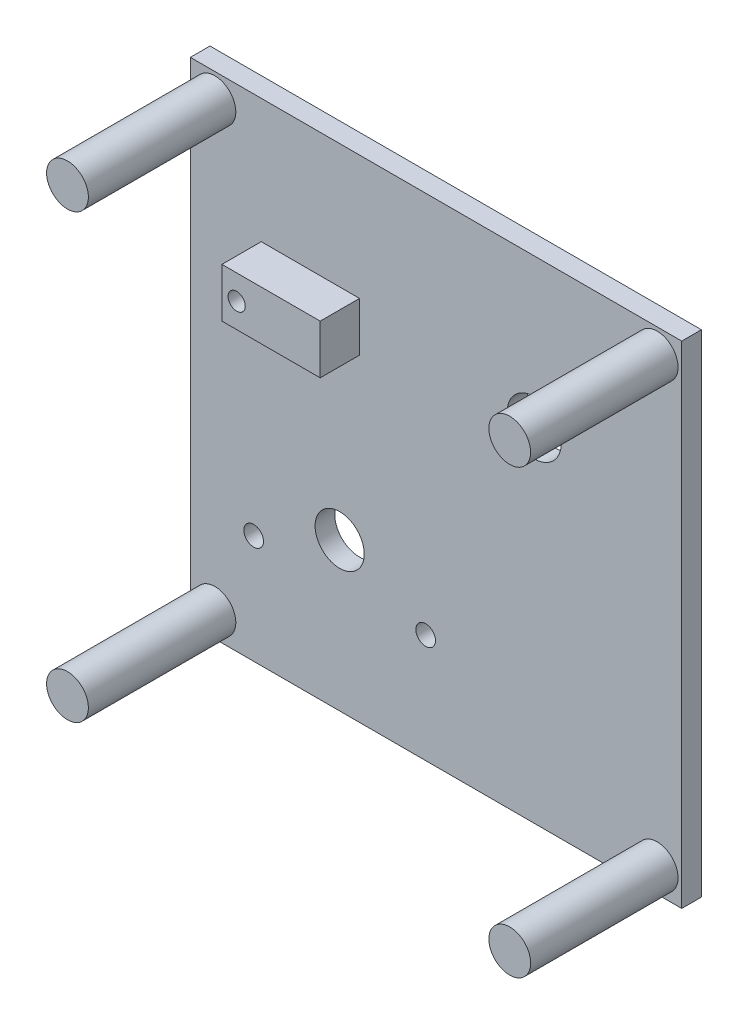
ISO-10303-21;
HEADER;
FILE_DESCRIPTION(('STEP AP214'),'2;1');
FILE_NAME('part.step','',(''),(''),'','','');
FILE_SCHEMA(('AUTOMOTIVE_DESIGN { 1 0 10303 214 1 1 1 1 }'));
ENDSEC;
DATA;
#1=APPLICATION_CONTEXT('core data for automotive mechanical design processes');
#2=APPLICATION_PROTOCOL_DEFINITION('international standard','automotive_design',2000,#1);
#3=PRODUCT_CONTEXT('',#1,'mechanical');
#4=PRODUCT('Part','Part','',(#3));
#5=PRODUCT_RELATED_PRODUCT_CATEGORY('part','',(#4));
#6=PRODUCT_DEFINITION_FORMATION('','',#4);
#7=PRODUCT_DEFINITION_CONTEXT('part definition',#1,'design');
#8=PRODUCT_DEFINITION('design','',#6,#7);
#9=PRODUCT_DEFINITION_SHAPE('','',#8);
#10=(LENGTH_UNIT() NAMED_UNIT(*) SI_UNIT(.MILLI.,.METRE.));
#11=(NAMED_UNIT(*) PLANE_ANGLE_UNIT() SI_UNIT($,.RADIAN.));
#12=(NAMED_UNIT(*) SI_UNIT($,.STERADIAN.) SOLID_ANGLE_UNIT());
#13=UNCERTAINTY_MEASURE_WITH_UNIT(LENGTH_MEASURE(1.E-05),#10,'distance_accuracy_value','');
#14=(GEOMETRIC_REPRESENTATION_CONTEXT(3) GLOBAL_UNCERTAINTY_ASSIGNED_CONTEXT((#13)) GLOBAL_UNIT_ASSIGNED_CONTEXT((#10,
#11,#12)) REPRESENTATION_CONTEXT('',''));
#15=CARTESIAN_POINT('',(0.,0.,0.));
#16=DIRECTION('',(0.,0.,1.));
#17=DIRECTION('',(1.,0.,0.));
#18=AXIS2_PLACEMENT_3D('',#15,#16,#17);
#19=CARTESIAN_POINT('',(50.,-50.,4.));
#20=DIRECTION('',(-1.,0.,0.));
#21=DIRECTION('',(0.,0.,1.));
#22=AXIS2_PLACEMENT_3D('',#19,#20,#21);
#23=PLANE('',#22);
#24=DIRECTION('',(0.,1.,0.));
#25=VECTOR('',#24,1.);
#26=CARTESIAN_POINT('',(50.,-50.,0.));
#27=LINE('',#26,#25);
#28=CARTESIAN_POINT('',(50.,-50.,0.));
#29=VERTEX_POINT('',#28);
#30=CARTESIAN_POINT('',(50.,50.,0.));
#31=VERTEX_POINT('',#30);
#32=EDGE_CURVE('E177',#29,#31,#27,.T.);
#33=ORIENTED_EDGE('',*,*,#32,.T.);
#34=DIRECTION('',(0.,0.,-1.));
#35=VECTOR('',#34,1.);
#36=CARTESIAN_POINT('',(50.,50.,4.));
#37=LINE('',#36,#35);
#38=CARTESIAN_POINT('',(50.,50.,4.));
#39=VERTEX_POINT('',#38);
#40=EDGE_CURVE('E204',#39,#31,#37,.T.);
#41=ORIENTED_EDGE('',*,*,#40,.F.);
#42=DIRECTION('',(0.,1.,0.));
#43=VECTOR('',#42,1.);
#44=CARTESIAN_POINT('',(50.,-50.,4.));
#45=LINE('',#44,#43);
#46=CARTESIAN_POINT('',(50.,-50.,4.));
#47=VERTEX_POINT('',#46);
#48=EDGE_CURVE('E178',#47,#39,#45,.T.);
#49=ORIENTED_EDGE('',*,*,#48,.F.);
#50=DIRECTION('',(0.,0.,-1.));
#51=VECTOR('',#50,1.);
#52=CARTESIAN_POINT('',(50.,-50.,4.));
#53=LINE('',#52,#51);
#54=EDGE_CURVE('E188',#47,#29,#53,.T.);
#55=ORIENTED_EDGE('',*,*,#54,.T.);
#56=EDGE_LOOP('',(#33,#41,#49,#55));
#57=FACE_BOUND('',#56,.T.);
#58=ADVANCED_FACE('F32',(#57),#23,.F.);
#59=CARTESIAN_POINT('',(-50.,50.,4.));
#60=DIRECTION('',(0.,-1.,0.));
#61=DIRECTION('',(0.,0.,-1.));
#62=AXIS2_PLACEMENT_3D('',#59,#60,#61);
#63=PLANE('',#62);
#64=DIRECTION('',(-1.,0.,0.));
#65=VECTOR('',#64,1.);
#66=CARTESIAN_POINT('',(-50.,50.,0.));
#67=LINE('',#66,#65);
#68=CARTESIAN_POINT('',(-50.,50.,0.));
#69=VERTEX_POINT('',#68);
#70=EDGE_CURVE('E191',#31,#69,#67,.T.);
#71=ORIENTED_EDGE('',*,*,#70,.T.);
#72=DIRECTION('',(0.,0.,-1.));
#73=VECTOR('',#72,1.);
#74=CARTESIAN_POINT('',(-50.,50.,4.));
#75=LINE('',#74,#73);
#76=CARTESIAN_POINT('',(-50.,50.,4.));
#77=VERTEX_POINT('',#76);
#78=EDGE_CURVE('E201',#77,#69,#75,.T.);
#79=ORIENTED_EDGE('',*,*,#78,.F.);
#80=DIRECTION('',(-1.,0.,0.));
#81=VECTOR('',#80,1.);
#82=CARTESIAN_POINT('',(-50.,50.,4.));
#83=LINE('',#82,#81);
#84=EDGE_CURVE('E181',#39,#77,#83,.T.);
#85=ORIENTED_EDGE('',*,*,#84,.F.);
#86=ORIENTED_EDGE('',*,*,#40,.T.);
#87=EDGE_LOOP('',(#71,#79,#85,#86));
#88=FACE_BOUND('',#87,.T.);
#89=ADVANCED_FACE('F237',(#88),#63,.F.);
#90=CARTESIAN_POINT('',(-50.,-50.,4.));
#91=DIRECTION('',(1.,0.,0.));
#92=DIRECTION('',(0.,0.,-1.));
#93=AXIS2_PLACEMENT_3D('',#90,#91,#92);
#94=PLANE('',#93);
#95=DIRECTION('',(0.,-1.,0.));
#96=VECTOR('',#95,1.);
#97=CARTESIAN_POINT('',(-50.,-50.,0.));
#98=LINE('',#97,#96);
#99=CARTESIAN_POINT('',(-50.,-50.,0.));
#100=VERTEX_POINT('',#99);
#101=EDGE_CURVE('E193',#69,#100,#98,.T.);
#102=ORIENTED_EDGE('',*,*,#101,.T.);
#103=DIRECTION('',(0.,0.,-1.));
#104=VECTOR('',#103,1.);
#105=CARTESIAN_POINT('',(-50.,-50.,4.));
#106=LINE('',#105,#104);
#107=CARTESIAN_POINT('',(-50.,-50.,4.));
#108=VERTEX_POINT('',#107);
#109=EDGE_CURVE('E198',#108,#100,#106,.T.);
#110=ORIENTED_EDGE('',*,*,#109,.F.);
#111=DIRECTION('',(0.,-1.,0.));
#112=VECTOR('',#111,1.);
#113=CARTESIAN_POINT('',(-50.,-50.,4.));
#114=LINE('',#113,#112);
#115=EDGE_CURVE('E184',#77,#108,#114,.T.);
#116=ORIENTED_EDGE('',*,*,#115,.F.);
#117=ORIENTED_EDGE('',*,*,#78,.T.);
#118=EDGE_LOOP('',(#102,#110,#116,#117));
#119=FACE_BOUND('',#118,.T.);
#120=ADVANCED_FACE('F242',(#119),#94,.F.);
#121=CARTESIAN_POINT('',(-50.,-50.,4.));
#122=DIRECTION('',(0.,1.,0.));
#123=DIRECTION('',(0.,0.,1.));
#124=AXIS2_PLACEMENT_3D('',#121,#122,#123);
#125=PLANE('',#124);
#126=DIRECTION('',(1.,0.,0.));
#127=VECTOR('',#126,1.);
#128=CARTESIAN_POINT('',(-50.,-50.,0.));
#129=LINE('',#128,#127);
#130=EDGE_CURVE('E182',#100,#29,#129,.T.);
#131=ORIENTED_EDGE('',*,*,#130,.T.);
#132=ORIENTED_EDGE('',*,*,#54,.F.);
#133=DIRECTION('',(1.,0.,0.));
#134=VECTOR('',#133,1.);
#135=CARTESIAN_POINT('',(-50.,-50.,4.));
#136=LINE('',#135,#134);
#137=EDGE_CURVE('E186',#108,#47,#136,.T.);
#138=ORIENTED_EDGE('',*,*,#137,.F.);
#139=ORIENTED_EDGE('',*,*,#109,.T.);
#140=EDGE_LOOP('',(#131,#132,#138,#139));
#141=FACE_BOUND('',#140,.T.);
#142=ADVANCED_FACE('F221',(#141),#125,.F.);
#143=CARTESIAN_POINT('',(0.,0.,4.));
#144=DIRECTION('',(0.,0.,-1.));
#145=DIRECTION('',(-1.,0.,0.));
#146=AXIS2_PLACEMENT_3D('',#143,#144,#145);
#147=PLANE('',#146);
#148=CARTESIAN_POINT('',(19.9832422219013,19.7310085100066,4.));
#149=DIRECTION('',(0.,0.,-1.));
#150=DIRECTION('',(-1.,0.,0.));
#151=AXIS2_PLACEMENT_3D('',#148,#149,#150);
#152=CIRCLE('',#151,5.5);
#153=CARTESIAN_POINT('',(14.4832422219013,19.7310085100066,4.));
#154=VERTEX_POINT('',#153);
#155=EDGE_CURVE('E595',#154,#154,#152,.T.);
#156=ORIENTED_EDGE('',*,*,#155,.T.);
#157=EDGE_LOOP('',(#156));
#158=FACE_BOUND('',#157,.T.);
#159=DIRECTION('',(0.,1.,0.));
#160=VECTOR('',#159,1.);
#161=CARTESIAN_POINT('',(-15.5711530411997,14.7310085100066,4.));
#162=LINE('',#161,#160);
#163=CARTESIAN_POINT('',(-15.5711530411997,14.7310085100066,4.));
#164=VERTEX_POINT('',#163);
#165=CARTESIAN_POINT('',(-15.5711530411997,24.7310085100066,4.));
#166=VERTEX_POINT('',#165);
#167=EDGE_CURVE('E117',#164,#166,#162,.T.);
#168=ORIENTED_EDGE('',*,*,#167,.F.);
#169=DIRECTION('',(1.,0.,0.));
#170=VECTOR('',#169,1.);
#171=CARTESIAN_POINT('',(-35.5711530411997,14.7310085100066,4.));
#172=LINE('',#171,#170);
#173=CARTESIAN_POINT('',(-35.5711530411997,14.7310085100066,4.));
#174=VERTEX_POINT('',#173);
#175=EDGE_CURVE('E114',#174,#164,#172,.T.);
#176=ORIENTED_EDGE('',*,*,#175,.F.);
#177=DIRECTION('',(0.,-1.,0.));
#178=VECTOR('',#177,1.);
#179=CARTESIAN_POINT('',(-35.5711530411997,14.7310085100066,4.));
#180=LINE('',#179,#178);
#181=CARTESIAN_POINT('',(-35.5711530411997,24.7310085100066,4.));
#182=VERTEX_POINT('',#181);
#183=EDGE_CURVE('E51',#182,#174,#180,.T.);
#184=ORIENTED_EDGE('',*,*,#183,.F.);
#185=DIRECTION('',(-1.,0.,0.));
#186=VECTOR('',#185,1.);
#187=CARTESIAN_POINT('',(-35.5711530411997,24.7310085100066,4.));
#188=LINE('',#187,#186);
#189=EDGE_CURVE('E46',#166,#182,#188,.T.);
#190=ORIENTED_EDGE('',*,*,#189,.F.);
#191=EDGE_LOOP('',(#168,#176,#184,#190));
#192=FACE_BOUND('',#191,.T.);
#193=CARTESIAN_POINT('',(-37.1117120269709,-27.8639457388657,4.));
#194=DIRECTION('',(0.,0.,-1.));
#195=DIRECTION('',(-1.,0.,0.));
#196=AXIS2_PLACEMENT_3D('',#193,#194,#195);
#197=CIRCLE('',#196,2.00000000000001);
#198=CARTESIAN_POINT('',(-39.1117120269709,-27.8639457388657,4.));
#199=VERTEX_POINT('',#198);
#200=EDGE_CURVE('E132',#199,#199,#197,.T.);
#201=ORIENTED_EDGE('',*,*,#200,.T.);
#202=EDGE_LOOP('',(#201));
#203=FACE_BOUND('',#202,.T.);
#204=CARTESIAN_POINT('',(-19.6117120269709,-19.8639457388657,4.));
#205=DIRECTION('',(0.,0.,-1.));
#206=DIRECTION('',(-1.,0.,0.));
#207=AXIS2_PLACEMENT_3D('',#204,#205,#206);
#208=CIRCLE('',#207,5.00000000000001);
#209=CARTESIAN_POINT('',(-24.6117120269709,-19.8639457388657,4.));
#210=VERTEX_POINT('',#209);
#211=EDGE_CURVE('E128',#210,#210,#208,.T.);
#212=ORIENTED_EDGE('',*,*,#211,.T.);
#213=EDGE_LOOP('',(#212));
#214=FACE_BOUND('',#213,.T.);
#215=CARTESIAN_POINT('',(-2.11171202697091,-27.8639457388657,4.));
#216=DIRECTION('',(0.,0.,-1.));
#217=DIRECTION('',(-1.,0.,0.));
#218=AXIS2_PLACEMENT_3D('',#215,#216,#217);
#219=CIRCLE('',#218,2.);
#220=CARTESIAN_POINT('',(-4.11171202697092,-27.8639457388657,4.));
#221=VERTEX_POINT('',#220);
#222=EDGE_CURVE('E138',#221,#221,#219,.T.);
#223=ORIENTED_EDGE('',*,*,#222,.T.);
#224=EDGE_LOOP('',(#223));
#225=FACE_BOUND('',#224,.T.);
#226=CARTESIAN_POINT('',(45.,-45.,4.));
#227=DIRECTION('',(0.,0.,-1.));
#228=DIRECTION('',(-1.,0.,0.));
#229=AXIS2_PLACEMENT_3D('',#226,#227,#228);
#230=CIRCLE('',#229,4.25);
#231=CARTESIAN_POINT('',(40.75,-45.,4.));
#232=VERTEX_POINT('',#231);
#233=EDGE_CURVE('E11',#232,#232,#230,.F.);
#234=ORIENTED_EDGE('',*,*,#233,.F.);
#235=EDGE_LOOP('',(#234));
#236=FACE_BOUND('',#235,.T.);
#237=CARTESIAN_POINT('',(-45.,-45.,4.));
#238=DIRECTION('',(0.,0.,-1.));
#239=DIRECTION('',(-1.,0.,0.));
#240=AXIS2_PLACEMENT_3D('',#237,#238,#239);
#241=CIRCLE('',#240,4.25);
#242=CARTESIAN_POINT('',(-49.25,-45.,4.));
#243=VERTEX_POINT('',#242);
#244=EDGE_CURVE('E39',#243,#243,#241,.F.);
#245=ORIENTED_EDGE('',*,*,#244,.F.);
#246=EDGE_LOOP('',(#245));
#247=FACE_BOUND('',#246,.T.);
#248=CARTESIAN_POINT('',(-45.,45.,4.));
#249=DIRECTION('',(0.,0.,-1.));
#250=DIRECTION('',(-1.,0.,0.));
#251=AXIS2_PLACEMENT_3D('',#248,#249,#250);
#252=CIRCLE('',#251,4.25);
#253=CARTESIAN_POINT('',(-49.25,45.,4.));
#254=VERTEX_POINT('',#253);
#255=EDGE_CURVE('E210',#254,#254,#252,.F.);
#256=ORIENTED_EDGE('',*,*,#255,.F.);
#257=EDGE_LOOP('',(#256));
#258=FACE_BOUND('',#257,.T.);
#259=CARTESIAN_POINT('',(45.,45.,4.));
#260=DIRECTION('',(0.,0.,-1.));
#261=DIRECTION('',(-1.,0.,0.));
#262=AXIS2_PLACEMENT_3D('',#259,#260,#261);
#263=CIRCLE('',#262,4.25);
#264=CARTESIAN_POINT('',(40.75,45.,4.));
#265=VERTEX_POINT('',#264);
#266=EDGE_CURVE('E207',#265,#265,#263,.F.);
#267=ORIENTED_EDGE('',*,*,#266,.F.);
#268=EDGE_LOOP('',(#267));
#269=FACE_BOUND('',#268,.T.);
#270=ORIENTED_EDGE('',*,*,#48,.T.);
#271=ORIENTED_EDGE('',*,*,#84,.T.);
#272=ORIENTED_EDGE('',*,*,#115,.T.);
#273=ORIENTED_EDGE('',*,*,#137,.T.);
#274=EDGE_LOOP('',(#270,#271,#272,#273));
#275=FACE_BOUND('',#274,.T.);
#276=ADVANCED_FACE('F217',(#158,#192,#203,#214,#225,#236,#247,#258,#269,#275),#147,.F.);
#277=CARTESIAN_POINT('',(0.,0.,0.));
#278=DIRECTION('',(0.,0.,-1.));
#279=DIRECTION('',(-1.,0.,0.));
#280=AXIS2_PLACEMENT_3D('',#277,#278,#279);
#281=PLANE('',#280);
#282=CARTESIAN_POINT('',(19.9832422219013,19.7310085100066,0.));
#283=DIRECTION('',(0.,0.,-1.));
#284=DIRECTION('',(-1.,0.,0.));
#285=AXIS2_PLACEMENT_3D('',#282,#283,#284);
#286=CIRCLE('',#285,5.5);
#287=CARTESIAN_POINT('',(14.4832422219013,19.7310085100066,0.));
#288=VERTEX_POINT('',#287);
#289=EDGE_CURVE('E600',#288,#288,#286,.T.);
#290=ORIENTED_EDGE('',*,*,#289,.F.);
#291=EDGE_LOOP('',(#290));
#292=FACE_BOUND('',#291,.T.);
#293=CARTESIAN_POINT('',(-37.1117120269709,-27.8639457388657,0.));
#294=DIRECTION('',(0.,0.,1.));
#295=DIRECTION('',(1.,0.,0.));
#296=AXIS2_PLACEMENT_3D('',#293,#294,#295);
#297=CIRCLE('',#296,2.00000000000001);
#298=CARTESIAN_POINT('',(-35.1117120269709,-27.8639457388657,0.));
#299=VERTEX_POINT('',#298);
#300=EDGE_CURVE('E121',#299,#299,#297,.T.);
#301=ORIENTED_EDGE('',*,*,#300,.T.);
#302=EDGE_LOOP('',(#301));
#303=FACE_BOUND('',#302,.T.);
#304=CARTESIAN_POINT('',(-19.6117120269709,-19.8639457388657,0.));
#305=DIRECTION('',(0.,0.,1.));
#306=DIRECTION('',(1.,0.,0.));
#307=AXIS2_PLACEMENT_3D('',#304,#305,#306);
#308=CIRCLE('',#307,5.00000000000001);
#309=CARTESIAN_POINT('',(-14.6117120269709,-19.8639457388657,0.));
#310=VERTEX_POINT('',#309);
#311=EDGE_CURVE('E118',#310,#310,#308,.T.);
#312=ORIENTED_EDGE('',*,*,#311,.T.);
#313=EDGE_LOOP('',(#312));
#314=FACE_BOUND('',#313,.T.);
#315=CARTESIAN_POINT('',(-2.11171202697091,-27.8639457388657,0.));
#316=DIRECTION('',(0.,0.,1.));
#317=DIRECTION('',(1.,0.,0.));
#318=AXIS2_PLACEMENT_3D('',#315,#316,#317);
#319=CIRCLE('',#318,2.);
#320=CARTESIAN_POINT('',(-0.11171202697091,-27.8639457388657,0.));
#321=VERTEX_POINT('',#320);
#322=EDGE_CURVE('E135',#321,#321,#319,.T.);
#323=ORIENTED_EDGE('',*,*,#322,.T.);
#324=EDGE_LOOP('',(#323));
#325=FACE_BOUND('',#324,.T.);
#326=CARTESIAN_POINT('',(-45.,45.,0.));
#327=DIRECTION('',(0.,0.,-1.));
#328=DIRECTION('',(-1.,0.,0.));
#329=AXIS2_PLACEMENT_3D('',#326,#327,#328);
#330=CIRCLE('',#329,4.75);
#331=CARTESIAN_POINT('',(-49.75,45.,0.));
#332=VERTEX_POINT('',#331);
#333=EDGE_CURVE('E146',#332,#332,#330,.T.);
#334=ORIENTED_EDGE('',*,*,#333,.F.);
#335=EDGE_LOOP('',(#334));
#336=FACE_BOUND('',#335,.T.);
#337=CARTESIAN_POINT('',(45.,-45.,0.));
#338=DIRECTION('',(0.,0.,-1.));
#339=DIRECTION('',(-1.,0.,0.));
#340=AXIS2_PLACEMENT_3D('',#337,#338,#339);
#341=CIRCLE('',#340,4.75);
#342=CARTESIAN_POINT('',(40.25,-45.,0.));
#343=VERTEX_POINT('',#342);
#344=EDGE_CURVE('E152',#343,#343,#341,.T.);
#345=ORIENTED_EDGE('',*,*,#344,.F.);
#346=EDGE_LOOP('',(#345));
#347=FACE_BOUND('',#346,.T.);
#348=CARTESIAN_POINT('',(-45.,-45.,0.));
#349=DIRECTION('',(0.,0.,-1.));
#350=DIRECTION('',(-1.,0.,0.));
#351=AXIS2_PLACEMENT_3D('',#348,#349,#350);
#352=CIRCLE('',#351,4.75);
#353=CARTESIAN_POINT('',(-49.75,-45.,0.));
#354=VERTEX_POINT('',#353);
#355=EDGE_CURVE('E141',#354,#354,#352,.T.);
#356=ORIENTED_EDGE('',*,*,#355,.F.);
#357=EDGE_LOOP('',(#356));
#358=FACE_BOUND('',#357,.T.);
#359=CARTESIAN_POINT('',(45.,45.,0.));
#360=DIRECTION('',(0.,0.,-1.));
#361=DIRECTION('',(-1.,0.,0.));
#362=AXIS2_PLACEMENT_3D('',#359,#360,#361);
#363=CIRCLE('',#362,4.75);
#364=CARTESIAN_POINT('',(40.25,45.,0.));
#365=VERTEX_POINT('',#364);
#366=EDGE_CURVE('E145',#365,#365,#363,.T.);
#367=ORIENTED_EDGE('',*,*,#366,.F.);
#368=EDGE_LOOP('',(#367));
#369=FACE_BOUND('',#368,.T.);
#370=ORIENTED_EDGE('',*,*,#32,.F.);
#371=ORIENTED_EDGE('',*,*,#130,.F.);
#372=ORIENTED_EDGE('',*,*,#101,.F.);
#373=ORIENTED_EDGE('',*,*,#70,.F.);
#374=EDGE_LOOP('',(#370,#371,#372,#373));
#375=FACE_BOUND('',#374,.T.);
#376=ADVANCED_FACE('F220',(#292,#303,#314,#325,#336,#347,#358,#369,#375),#281,.T.);
#377=CARTESIAN_POINT('',(45.,45.,34.));
#378=DIRECTION('',(0.,0.,-1.));
#379=DIRECTION('',(-1.,0.,0.));
#380=AXIS2_PLACEMENT_3D('',#377,#378,#379);
#381=CYLINDRICAL_SURFACE('',#380,4.25);
#382=CARTESIAN_POINT('',(45.,45.,34.));
#383=DIRECTION('',(0.,0.,1.));
#384=DIRECTION('',(1.,0.,0.));
#385=AXIS2_PLACEMENT_3D('',#382,#383,#384);
#386=CIRCLE('',#385,4.25);
#387=CARTESIAN_POINT('',(49.25,45.,34.));
#388=VERTEX_POINT('',#387);
#389=EDGE_CURVE('E174',#388,#388,#386,.T.);
#390=ORIENTED_EDGE('',*,*,#389,.F.);
#391=EDGE_LOOP('',(#390));
#392=FACE_BOUND('',#391,.T.);
#393=ORIENTED_EDGE('',*,*,#266,.T.);
#394=EDGE_LOOP('',(#393));
#395=FACE_BOUND('',#394,.T.);
#396=ADVANCED_FACE('F247',(#392,#395),#381,.T.);
#397=CARTESIAN_POINT('',(45.,45.,34.));
#398=DIRECTION('',(0.,0.,1.));
#399=DIRECTION('',(1.,0.,0.));
#400=AXIS2_PLACEMENT_3D('',#397,#398,#399);
#401=PLANE('',#400);
#402=ORIENTED_EDGE('',*,*,#389,.T.);
#403=EDGE_LOOP('',(#402));
#404=FACE_BOUND('',#403,.T.);
#405=ADVANCED_FACE('F253',(#404),#401,.T.);
#406=CARTESIAN_POINT('',(-45.,45.,34.));
#407=DIRECTION('',(0.,0.,-1.));
#408=DIRECTION('',(-1.,0.,0.));
#409=AXIS2_PLACEMENT_3D('',#406,#407,#408);
#410=CYLINDRICAL_SURFACE('',#409,4.25);
#411=CARTESIAN_POINT('',(-45.,45.,34.));
#412=DIRECTION('',(0.,0.,1.));
#413=DIRECTION('',(1.,0.,0.));
#414=AXIS2_PLACEMENT_3D('',#411,#412,#413);
#415=CIRCLE('',#414,4.25);
#416=CARTESIAN_POINT('',(-40.75,45.,34.));
#417=VERTEX_POINT('',#416);
#418=EDGE_CURVE('E171',#417,#417,#415,.T.);
#419=ORIENTED_EDGE('',*,*,#418,.F.);
#420=EDGE_LOOP('',(#419));
#421=FACE_BOUND('',#420,.T.);
#422=ORIENTED_EDGE('',*,*,#255,.T.);
#423=EDGE_LOOP('',(#422));
#424=FACE_BOUND('',#423,.T.);
#425=ADVANCED_FACE('F468',(#421,#424),#410,.T.);
#426=CARTESIAN_POINT('',(-45.,45.,34.));
#427=DIRECTION('',(0.,0.,1.));
#428=DIRECTION('',(1.,0.,0.));
#429=AXIS2_PLACEMENT_3D('',#426,#427,#428);
#430=PLANE('',#429);
#431=ORIENTED_EDGE('',*,*,#418,.T.);
#432=EDGE_LOOP('',(#431));
#433=FACE_BOUND('',#432,.T.);
#434=ADVANCED_FACE('F460',(#433),#430,.T.);
#435=CARTESIAN_POINT('',(-45.,-45.,34.));
#436=DIRECTION('',(0.,0.,-1.));
#437=DIRECTION('',(-1.,0.,0.));
#438=AXIS2_PLACEMENT_3D('',#435,#436,#437);
#439=CYLINDRICAL_SURFACE('',#438,4.25);
#440=CARTESIAN_POINT('',(-45.,-45.,34.));
#441=DIRECTION('',(0.,0.,1.));
#442=DIRECTION('',(1.,0.,0.));
#443=AXIS2_PLACEMENT_3D('',#440,#441,#442);
#444=CIRCLE('',#443,4.25);
#445=CARTESIAN_POINT('',(-40.75,-45.,34.));
#446=VERTEX_POINT('',#445);
#447=EDGE_CURVE('E168',#446,#446,#444,.T.);
#448=ORIENTED_EDGE('',*,*,#447,.F.);
#449=EDGE_LOOP('',(#448));
#450=FACE_BOUND('',#449,.T.);
#451=ORIENTED_EDGE('',*,*,#244,.T.);
#452=EDGE_LOOP('',(#451));
#453=FACE_BOUND('',#452,.T.);
#454=ADVANCED_FACE('F215',(#450,#453),#439,.T.);
#455=CARTESIAN_POINT('',(-45.,-45.,34.));
#456=DIRECTION('',(0.,0.,1.));
#457=DIRECTION('',(1.,0.,0.));
#458=AXIS2_PLACEMENT_3D('',#455,#456,#457);
#459=PLANE('',#458);
#460=ORIENTED_EDGE('',*,*,#447,.T.);
#461=EDGE_LOOP('',(#460));
#462=FACE_BOUND('',#461,.T.);
#463=ADVANCED_FACE('F445',(#462),#459,.T.);
#464=CARTESIAN_POINT('',(45.,-45.,34.));
#465=DIRECTION('',(0.,0.,-1.));
#466=DIRECTION('',(-1.,0.,0.));
#467=AXIS2_PLACEMENT_3D('',#464,#465,#466);
#468=CYLINDRICAL_SURFACE('',#467,4.25);
#469=CARTESIAN_POINT('',(45.,-45.,34.));
#470=DIRECTION('',(0.,0.,1.));
#471=DIRECTION('',(1.,0.,0.));
#472=AXIS2_PLACEMENT_3D('',#469,#470,#471);
#473=CIRCLE('',#472,4.25);
#474=CARTESIAN_POINT('',(49.25,-45.,34.));
#475=VERTEX_POINT('',#474);
#476=EDGE_CURVE('E163',#475,#475,#473,.T.);
#477=ORIENTED_EDGE('',*,*,#476,.F.);
#478=EDGE_LOOP('',(#477));
#479=FACE_BOUND('',#478,.T.);
#480=ORIENTED_EDGE('',*,*,#233,.T.);
#481=EDGE_LOOP('',(#480));
#482=FACE_BOUND('',#481,.T.);
#483=ADVANCED_FACE('F437',(#479,#482),#468,.T.);
#484=CARTESIAN_POINT('',(45.,-45.,34.));
#485=DIRECTION('',(0.,0.,1.));
#486=DIRECTION('',(1.,0.,0.));
#487=AXIS2_PLACEMENT_3D('',#484,#485,#486);
#488=PLANE('',#487);
#489=ORIENTED_EDGE('',*,*,#476,.T.);
#490=EDGE_LOOP('',(#489));
#491=FACE_BOUND('',#490,.T.);
#492=ADVANCED_FACE('F429',(#491),#488,.T.);
#493=CARTESIAN_POINT('',(45.,45.,1.5));
#494=DIRECTION('',(0.,0.,-1.));
#495=DIRECTION('',(-1.,0.,0.));
#496=AXIS2_PLACEMENT_3D('',#493,#494,#495);
#497=CYLINDRICAL_SURFACE('',#496,4.75);
#498=CARTESIAN_POINT('',(45.,45.,1.5));
#499=DIRECTION('',(0.,0.,-1.));
#500=DIRECTION('',(-1.,0.,0.));
#501=AXIS2_PLACEMENT_3D('',#498,#499,#500);
#502=CIRCLE('',#501,4.75);
#503=CARTESIAN_POINT('',(40.25,45.,1.5));
#504=VERTEX_POINT('',#503);
#505=EDGE_CURVE('E160',#504,#504,#502,.T.);
#506=ORIENTED_EDGE('',*,*,#505,.F.);
#507=EDGE_LOOP('',(#506));
#508=FACE_BOUND('',#507,.T.);
#509=ORIENTED_EDGE('',*,*,#366,.T.);
#510=EDGE_LOOP('',(#509));
#511=FACE_BOUND('',#510,.T.);
#512=ADVANCED_FACE('F421',(#508,#511),#497,.F.);
#513=CARTESIAN_POINT('',(45.,45.,1.5));
#514=DIRECTION('',(0.,0.,-1.));
#515=DIRECTION('',(-1.,0.,0.));
#516=AXIS2_PLACEMENT_3D('',#513,#514,#515);
#517=PLANE('',#516);
#518=ORIENTED_EDGE('',*,*,#505,.T.);
#519=EDGE_LOOP('',(#518));
#520=FACE_BOUND('',#519,.T.);
#521=ADVANCED_FACE('F413',(#520),#517,.T.);
#522=CARTESIAN_POINT('',(-45.,-45.,1.5));
#523=DIRECTION('',(0.,0.,-1.));
#524=DIRECTION('',(-1.,0.,0.));
#525=AXIS2_PLACEMENT_3D('',#522,#523,#524);
#526=CYLINDRICAL_SURFACE('',#525,4.75);
#527=CARTESIAN_POINT('',(-45.,-45.,1.5));
#528=DIRECTION('',(0.,0.,-1.));
#529=DIRECTION('',(-1.,0.,0.));
#530=AXIS2_PLACEMENT_3D('',#527,#528,#529);
#531=CIRCLE('',#530,4.75);
#532=CARTESIAN_POINT('',(-49.75,-45.,1.5));
#533=VERTEX_POINT('',#532);
#534=EDGE_CURVE('E155',#533,#533,#531,.T.);
#535=ORIENTED_EDGE('',*,*,#534,.F.);
#536=EDGE_LOOP('',(#535));
#537=FACE_BOUND('',#536,.T.);
#538=ORIENTED_EDGE('',*,*,#355,.T.);
#539=EDGE_LOOP('',(#538));
#540=FACE_BOUND('',#539,.T.);
#541=ADVANCED_FACE('F405',(#537,#540),#526,.F.);
#542=CARTESIAN_POINT('',(-45.,-45.,1.5));
#543=DIRECTION('',(0.,0.,-1.));
#544=DIRECTION('',(-1.,0.,0.));
#545=AXIS2_PLACEMENT_3D('',#542,#543,#544);
#546=PLANE('',#545);
#547=ORIENTED_EDGE('',*,*,#534,.T.);
#548=EDGE_LOOP('',(#547));
#549=FACE_BOUND('',#548,.T.);
#550=ADVANCED_FACE('F397',(#549),#546,.T.);
#551=CARTESIAN_POINT('',(45.,-45.,1.5));
#552=DIRECTION('',(0.,0.,-1.));
#553=DIRECTION('',(-1.,0.,0.));
#554=AXIS2_PLACEMENT_3D('',#551,#552,#553);
#555=CYLINDRICAL_SURFACE('',#554,4.75);
#556=CARTESIAN_POINT('',(45.,-45.,1.5));
#557=DIRECTION('',(0.,0.,-1.));
#558=DIRECTION('',(-1.,0.,0.));
#559=AXIS2_PLACEMENT_3D('',#556,#557,#558);
#560=CIRCLE('',#559,4.75);
#561=CARTESIAN_POINT('',(40.25,-45.,1.5));
#562=VERTEX_POINT('',#561);
#563=EDGE_CURVE('E149',#562,#562,#560,.T.);
#564=ORIENTED_EDGE('',*,*,#563,.F.);
#565=EDGE_LOOP('',(#564));
#566=FACE_BOUND('',#565,.T.);
#567=ORIENTED_EDGE('',*,*,#344,.T.);
#568=EDGE_LOOP('',(#567));
#569=FACE_BOUND('',#568,.T.);
#570=ADVANCED_FACE('F389',(#566,#569),#555,.F.);
#571=CARTESIAN_POINT('',(45.,-45.,1.5));
#572=DIRECTION('',(0.,0.,-1.));
#573=DIRECTION('',(-1.,0.,0.));
#574=AXIS2_PLACEMENT_3D('',#571,#572,#573);
#575=PLANE('',#574);
#576=ORIENTED_EDGE('',*,*,#563,.T.);
#577=EDGE_LOOP('',(#576));
#578=FACE_BOUND('',#577,.T.);
#579=ADVANCED_FACE('F381',(#578),#575,.T.);
#580=CARTESIAN_POINT('',(-45.,45.,1.5));
#581=DIRECTION('',(0.,0.,-1.));
#582=DIRECTION('',(-1.,0.,0.));
#583=AXIS2_PLACEMENT_3D('',#580,#581,#582);
#584=CYLINDRICAL_SURFACE('',#583,4.75);
#585=CARTESIAN_POINT('',(-45.,45.,1.5));
#586=DIRECTION('',(0.,0.,-1.));
#587=DIRECTION('',(-1.,0.,0.));
#588=AXIS2_PLACEMENT_3D('',#585,#586,#587);
#589=CIRCLE('',#588,4.75);
#590=CARTESIAN_POINT('',(-49.75,45.,1.5));
#591=VERTEX_POINT('',#590);
#592=EDGE_CURVE('E142',#591,#591,#589,.T.);
#593=ORIENTED_EDGE('',*,*,#592,.F.);
#594=EDGE_LOOP('',(#593));
#595=FACE_BOUND('',#594,.T.);
#596=ORIENTED_EDGE('',*,*,#333,.T.);
#597=EDGE_LOOP('',(#596));
#598=FACE_BOUND('',#597,.T.);
#599=ADVANCED_FACE('F373',(#595,#598),#584,.F.);
#600=CARTESIAN_POINT('',(-45.,45.,1.5));
#601=DIRECTION('',(0.,0.,-1.));
#602=DIRECTION('',(-1.,0.,0.));
#603=AXIS2_PLACEMENT_3D('',#600,#601,#602);
#604=PLANE('',#603);
#605=ORIENTED_EDGE('',*,*,#592,.T.);
#606=EDGE_LOOP('',(#605));
#607=FACE_BOUND('',#606,.T.);
#608=ADVANCED_FACE('F365',(#607),#604,.T.);
#609=CARTESIAN_POINT('',(-2.11171202697091,-27.8639457388657,0.));
#610=DIRECTION('',(0.,0.,1.));
#611=DIRECTION('',(1.,0.,0.));
#612=AXIS2_PLACEMENT_3D('',#609,#610,#611);
#613=CYLINDRICAL_SURFACE('',#612,2.);
#614=ORIENTED_EDGE('',*,*,#322,.F.);
#615=EDGE_LOOP('',(#614));
#616=FACE_BOUND('',#615,.T.);
#617=ORIENTED_EDGE('',*,*,#222,.F.);
#618=EDGE_LOOP('',(#617));
#619=FACE_BOUND('',#618,.T.);
#620=ADVANCED_FACE('F357',(#616,#619),#613,.F.);
#621=CARTESIAN_POINT('',(-19.6117120269709,-19.8639457388657,0.));
#622=DIRECTION('',(0.,0.,1.));
#623=DIRECTION('',(1.,0.,0.));
#624=AXIS2_PLACEMENT_3D('',#621,#622,#623);
#625=CYLINDRICAL_SURFACE('',#624,5.00000000000001);
#626=ORIENTED_EDGE('',*,*,#311,.F.);
#627=EDGE_LOOP('',(#626));
#628=FACE_BOUND('',#627,.T.);
#629=ORIENTED_EDGE('',*,*,#211,.F.);
#630=EDGE_LOOP('',(#629));
#631=FACE_BOUND('',#630,.T.);
#632=ADVANCED_FACE('F349',(#628,#631),#625,.F.);
#633=CARTESIAN_POINT('',(-37.1117120269709,-27.8639457388657,0.));
#634=DIRECTION('',(0.,0.,1.));
#635=DIRECTION('',(1.,0.,0.));
#636=AXIS2_PLACEMENT_3D('',#633,#634,#635);
#637=CYLINDRICAL_SURFACE('',#636,2.00000000000001);
#638=ORIENTED_EDGE('',*,*,#300,.F.);
#639=EDGE_LOOP('',(#638));
#640=FACE_BOUND('',#639,.T.);
#641=ORIENTED_EDGE('',*,*,#200,.F.);
#642=EDGE_LOOP('',(#641));
#643=FACE_BOUND('',#642,.T.);
#644=ADVANCED_FACE('F342',(#640,#643),#637,.F.);
#645=CARTESIAN_POINT('',(0.,0.,12.));
#646=DIRECTION('',(0.,0.,-1.));
#647=DIRECTION('',(-1.,0.,0.));
#648=AXIS2_PLACEMENT_3D('',#645,#646,#647);
#649=PLANE('',#648);
#650=DIRECTION('',(0.,1.,0.));
#651=VECTOR('',#650,1.);
#652=CARTESIAN_POINT('',(-15.5711530411997,14.7310085100066,12.));
#653=LINE('',#652,#651);
#654=CARTESIAN_POINT('',(-15.5711530411997,14.7310085100066,12.));
#655=VERTEX_POINT('',#654);
#656=CARTESIAN_POINT('',(-15.5711530411997,24.7310085100066,12.));
#657=VERTEX_POINT('',#656);
#658=EDGE_CURVE('E104',#655,#657,#653,.T.);
#659=ORIENTED_EDGE('',*,*,#658,.T.);
#660=DIRECTION('',(-1.,0.,0.));
#661=VECTOR('',#660,1.);
#662=CARTESIAN_POINT('',(-35.5711530411997,24.7310085100066,12.));
#663=LINE('',#662,#661);
#664=CARTESIAN_POINT('',(-35.5711530411997,24.7310085100066,12.));
#665=VERTEX_POINT('',#664);
#666=EDGE_CURVE('E93',#657,#665,#663,.T.);
#667=ORIENTED_EDGE('',*,*,#666,.T.);
#668=DIRECTION('',(0.,-1.,0.));
#669=VECTOR('',#668,1.);
#670=CARTESIAN_POINT('',(-35.5711530411997,14.7310085100066,12.));
#671=LINE('',#670,#669);
#672=CARTESIAN_POINT('',(-35.5711530411997,14.7310085100066,12.));
#673=VERTEX_POINT('',#672);
#674=EDGE_CURVE('E103',#665,#673,#671,.T.);
#675=ORIENTED_EDGE('',*,*,#674,.T.);
#676=DIRECTION('',(1.,0.,0.));
#677=VECTOR('',#676,1.);
#678=CARTESIAN_POINT('',(-35.5711530411997,14.7310085100066,12.));
#679=LINE('',#678,#677);
#680=EDGE_CURVE('E110',#673,#655,#679,.T.);
#681=ORIENTED_EDGE('',*,*,#680,.T.);
#682=EDGE_LOOP('',(#659,#667,#675,#681));
#683=FACE_BOUND('',#682,.T.);
#684=CARTESIAN_POINT('',(-32.5711530411997,19.7310085100066,12.));
#685=DIRECTION('',(0.,0.,1.));
#686=DIRECTION('',(1.,0.,0.));
#687=AXIS2_PLACEMENT_3D('',#684,#685,#686);
#688=CIRCLE('',#687,1.75);
#689=CARTESIAN_POINT('',(-30.8211530411997,19.7310085100066,12.));
#690=VERTEX_POINT('',#689);
#691=EDGE_CURVE('E589',#690,#690,#688,.T.);
#692=ORIENTED_EDGE('',*,*,#691,.F.);
#693=EDGE_LOOP('',(#692));
#694=FACE_BOUND('',#693,.T.);
#695=ADVANCED_FACE('F107',(#683,#694),#649,.F.);
#696=CARTESIAN_POINT('',(-15.5711530411997,14.7310085100066,12.));
#697=DIRECTION('',(-1.,0.,0.));
#698=DIRECTION('',(0.,0.,1.));
#699=AXIS2_PLACEMENT_3D('',#696,#697,#698);
#700=PLANE('',#699);
#701=ORIENTED_EDGE('',*,*,#167,.T.);
#702=DIRECTION('',(0.,0.,-1.));
#703=VECTOR('',#702,1.);
#704=CARTESIAN_POINT('',(-15.5711530411997,24.7310085100066,12.));
#705=LINE('',#704,#703);
#706=EDGE_CURVE('E97',#657,#166,#705,.T.);
#707=ORIENTED_EDGE('',*,*,#706,.F.);
#708=ORIENTED_EDGE('',*,*,#658,.F.);
#709=DIRECTION('',(0.,0.,-1.));
#710=VECTOR('',#709,1.);
#711=CARTESIAN_POINT('',(-15.5711530411997,14.7310085100066,12.));
#712=LINE('',#711,#710);
#713=EDGE_CURVE('E583',#655,#164,#712,.T.);
#714=ORIENTED_EDGE('',*,*,#713,.T.);
#715=EDGE_LOOP('',(#701,#707,#708,#714));
#716=FACE_BOUND('',#715,.T.);
#717=ADVANCED_FACE('F116',(#716),#700,.F.);
#718=CARTESIAN_POINT('',(-35.5711530411997,24.7310085100066,12.));
#719=DIRECTION('',(0.,-1.,0.));
#720=DIRECTION('',(0.,0.,-1.));
#721=AXIS2_PLACEMENT_3D('',#718,#719,#720);
#722=PLANE('',#721);
#723=ORIENTED_EDGE('',*,*,#189,.T.);
#724=DIRECTION('',(0.,0.,-1.));
#725=VECTOR('',#724,1.);
#726=CARTESIAN_POINT('',(-35.5711530411997,24.7310085100066,12.));
#727=LINE('',#726,#725);
#728=EDGE_CURVE('E100',#665,#182,#727,.T.);
#729=ORIENTED_EDGE('',*,*,#728,.F.);
#730=ORIENTED_EDGE('',*,*,#666,.F.);
#731=ORIENTED_EDGE('',*,*,#706,.T.);
#732=EDGE_LOOP('',(#723,#729,#730,#731));
#733=FACE_BOUND('',#732,.T.);
#734=ADVANCED_FACE('F95',(#733),#722,.F.);
#735=CARTESIAN_POINT('',(-35.5711530411997,14.7310085100066,12.));
#736=DIRECTION('',(1.,0.,0.));
#737=DIRECTION('',(0.,0.,-1.));
#738=AXIS2_PLACEMENT_3D('',#735,#736,#737);
#739=PLANE('',#738);
#740=ORIENTED_EDGE('',*,*,#183,.T.);
#741=DIRECTION('',(0.,0.,-1.));
#742=VECTOR('',#741,1.);
#743=CARTESIAN_POINT('',(-35.5711530411997,14.7310085100066,12.));
#744=LINE('',#743,#742);
#745=EDGE_CURVE('E123',#673,#174,#744,.T.);
#746=ORIENTED_EDGE('',*,*,#745,.F.);
#747=ORIENTED_EDGE('',*,*,#674,.F.);
#748=ORIENTED_EDGE('',*,*,#728,.T.);
#749=EDGE_LOOP('',(#740,#746,#747,#748));
#750=FACE_BOUND('',#749,.T.);
#751=ADVANCED_FACE('F315',(#750),#739,.F.);
#752=CARTESIAN_POINT('',(-35.5711530411997,14.7310085100066,12.));
#753=DIRECTION('',(0.,1.,0.));
#754=DIRECTION('',(0.,0.,1.));
#755=AXIS2_PLACEMENT_3D('',#752,#753,#754);
#756=PLANE('',#755);
#757=ORIENTED_EDGE('',*,*,#175,.T.);
#758=ORIENTED_EDGE('',*,*,#713,.F.);
#759=ORIENTED_EDGE('',*,*,#680,.F.);
#760=ORIENTED_EDGE('',*,*,#745,.T.);
#761=EDGE_LOOP('',(#757,#758,#759,#760));
#762=FACE_BOUND('',#761,.T.);
#763=ADVANCED_FACE('F308',(#762),#756,.F.);
#764=CARTESIAN_POINT('',(-32.5711530411997,19.7310085100066,12.));
#765=DIRECTION('',(0.,0.,-1.));
#766=DIRECTION('',(-1.,0.,0.));
#767=AXIS2_PLACEMENT_3D('',#764,#765,#766);
#768=CYLINDRICAL_SURFACE('',#767,1.75);
#769=ORIENTED_EDGE('',*,*,#691,.T.);
#770=EDGE_LOOP('',(#769));
#771=FACE_BOUND('',#770,.T.);
#772=CARTESIAN_POINT('',(-32.5711530411997,19.7310085100066,4.));
#773=DIRECTION('',(0.,0.,1.));
#774=DIRECTION('',(1.,0.,0.));
#775=AXIS2_PLACEMENT_3D('',#772,#773,#774);
#776=CIRCLE('',#775,1.75);
#777=CARTESIAN_POINT('',(-30.8211530411997,19.7310085100066,4.));
#778=VERTEX_POINT('',#777);
#779=EDGE_CURVE('E592',#778,#778,#776,.T.);
#780=ORIENTED_EDGE('',*,*,#779,.F.);
#781=EDGE_LOOP('',(#780));
#782=FACE_BOUND('',#781,.T.);
#783=ADVANCED_FACE('F304',(#771,#782),#768,.F.);
#784=ORIENTED_EDGE('',*,*,#779,.T.);
#785=EDGE_LOOP('',(#784));
#786=FACE_BOUND('',#785,.T.);
#787=ADVANCED_FACE('F224',(#786),#147,.F.);
#788=CARTESIAN_POINT('',(19.9832422219013,19.7310085100066,8.));
#789=DIRECTION('',(0.,0.,-1.));
#790=DIRECTION('',(-1.,0.,0.));
#791=AXIS2_PLACEMENT_3D('',#788,#789,#790);
#792=CYLINDRICAL_SURFACE('',#791,5.5);
#793=ORIENTED_EDGE('',*,*,#289,.T.);
#794=EDGE_LOOP('',(#793));
#795=FACE_BOUND('',#794,.T.);
#796=ORIENTED_EDGE('',*,*,#155,.F.);
#797=EDGE_LOOP('',(#796));
#798=FACE_BOUND('',#797,.T.);
#799=ADVANCED_FACE('F292',(#795,#798),#792,.F.);
#800=CLOSED_SHELL('',(#58,#89,#120,#142,#276,#376,#396,#405,#425,#434,#454,#463,#483,#492,#512,
#521,#541,#550,#570,#579,#599,#608,#620,#632,#644,#695,#717,#734,#751,#763,#783,#787,#799));
#801=MANIFOLD_SOLID_BREP('B2',#800);
#802=ADVANCED_BREP_SHAPE_REPRESENTATION('',(#18,#801),#14);
#803=SHAPE_DEFINITION_REPRESENTATION(#9,#802);
ENDSEC;
END-ISO-10303-21;
